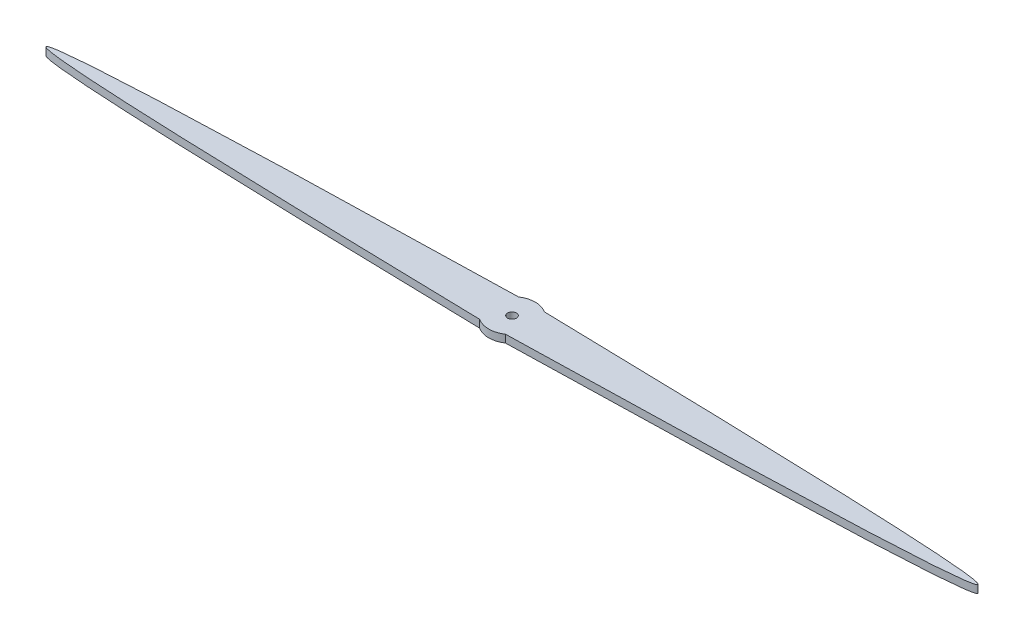
ISO-10303-21;
HEADER;
FILE_DESCRIPTION(('STEP AP214'),'2;1');
FILE_NAME('part.step','',(''),(''),'','','');
FILE_SCHEMA(('AUTOMOTIVE_DESIGN { 1 0 10303 214 1 1 1 1 }'));
ENDSEC;
DATA;
#1=APPLICATION_CONTEXT('core data for automotive mechanical design processes');
#2=APPLICATION_PROTOCOL_DEFINITION('international standard','automotive_design',2000,#1);
#3=PRODUCT_CONTEXT('',#1,'mechanical');
#4=PRODUCT('Part','Part','',(#3));
#5=PRODUCT_RELATED_PRODUCT_CATEGORY('part','',(#4));
#6=PRODUCT_DEFINITION_FORMATION('','',#4);
#7=PRODUCT_DEFINITION_CONTEXT('part definition',#1,'design');
#8=PRODUCT_DEFINITION('design','',#6,#7);
#9=PRODUCT_DEFINITION_SHAPE('','',#8);
#10=(LENGTH_UNIT() NAMED_UNIT(*) SI_UNIT(.MILLI.,.METRE.));
#11=(NAMED_UNIT(*) PLANE_ANGLE_UNIT() SI_UNIT($,.RADIAN.));
#12=(NAMED_UNIT(*) SI_UNIT($,.STERADIAN.) SOLID_ANGLE_UNIT());
#13=UNCERTAINTY_MEASURE_WITH_UNIT(LENGTH_MEASURE(1.E-05),#10,'distance_accuracy_value','');
#14=(GEOMETRIC_REPRESENTATION_CONTEXT(3) GLOBAL_UNCERTAINTY_ASSIGNED_CONTEXT((#13)) GLOBAL_UNIT_ASSIGNED_CONTEXT((#10,
#11,#12)) REPRESENTATION_CONTEXT('',''));
#15=CARTESIAN_POINT('',(0.,0.,0.));
#16=DIRECTION('',(0.,0.,1.));
#17=DIRECTION('',(1.,0.,0.));
#18=AXIS2_PLACEMENT_3D('',#15,#16,#17);
#19=CARTESIAN_POINT('',(152.4,2.5146,0.));
#20=DIRECTION('',(0.,1.,0.));
#21=DIRECTION('',(0.,0.,1.));
#22=AXIS2_PLACEMENT_3D('',#19,#20,#21);
#23=PLANE('',#22);
#24=CARTESIAN_POINT('',(4.21211348375136,2.5146,6.35));
#25=CARTESIAN_POINT('',(300.587886516249,2.5146,0.));
#26=CARTESIAN_POINT('',(4.21211348375136,2.5146,-6.35));
#27=B_SPLINE_CURVE_WITH_KNOTS('',2,(#24,#25,#26),.UNSPECIFIED.,.F.,.F.,(3,3),(0.,1.),.UNSPECIFIED.);
#28=CARTESIAN_POINT('',(4.21211348375136,2.5146,6.35));
#29=VERTEX_POINT('',#28);
#30=CARTESIAN_POINT('',(4.21211348375136,2.5146,-6.35));
#31=VERTEX_POINT('',#30);
#32=EDGE_CURVE('E98',#29,#31,#27,.T.);
#33=ORIENTED_EDGE('',*,*,#32,.T.);
#34=CARTESIAN_POINT('',(0.,2.5146,0.));
#35=DIRECTION('',(0.,1.,0.));
#36=DIRECTION('',(0.,0.,1.));
#37=AXIS2_PLACEMENT_3D('',#34,#35,#36);
#38=CIRCLE('',#37,7.62);
#39=CARTESIAN_POINT('',(-4.21211348375135,2.5146,-6.35));
#40=VERTEX_POINT('',#39);
#41=EDGE_CURVE('E85',#31,#40,#38,.T.);
#42=ORIENTED_EDGE('',*,*,#41,.T.);
#43=CARTESIAN_POINT('',(-4.21211348375136,2.5146,-6.35));
#44=CARTESIAN_POINT('',(-300.587886516249,2.5146,0.));
#45=CARTESIAN_POINT('',(-4.21211348375136,2.5146,6.35));
#46=B_SPLINE_CURVE_WITH_KNOTS('',2,(#43,#44,#45),.UNSPECIFIED.,.F.,.F.,(3,3),(0.,1.),.UNSPECIFIED.);
#47=CARTESIAN_POINT('',(-4.21211348375136,2.5146,6.35));
#48=VERTEX_POINT('',#47);
#49=EDGE_CURVE('E92',#40,#48,#46,.T.);
#50=ORIENTED_EDGE('',*,*,#49,.T.);
#51=CARTESIAN_POINT('',(0.,2.5146,0.));
#52=DIRECTION('',(0.,1.,0.));
#53=DIRECTION('',(0.,0.,1.));
#54=AXIS2_PLACEMENT_3D('',#51,#52,#53);
#55=CIRCLE('',#54,7.62);
#56=EDGE_CURVE('E95',#48,#29,#55,.T.);
#57=ORIENTED_EDGE('',*,*,#56,.T.);
#58=EDGE_LOOP('',(#33,#42,#50,#57));
#59=FACE_BOUND('',#58,.T.);
#60=CARTESIAN_POINT('',(0.,2.5146,0.));
#61=DIRECTION('',(0.,1.,0.));
#62=DIRECTION('',(0.,0.,1.));
#63=AXIS2_PLACEMENT_3D('',#60,#61,#62);
#64=CIRCLE('',#63,1.46304);
#65=CARTESIAN_POINT('',(0.,2.5146,1.46304));
#66=VERTEX_POINT('',#65);
#67=EDGE_CURVE('E139',#66,#66,#64,.T.);
#68=ORIENTED_EDGE('',*,*,#67,.F.);
#69=EDGE_LOOP('',(#68));
#70=FACE_BOUND('',#69,.T.);
#71=ADVANCED_FACE('F39',(#59,#70),#23,.T.);
#72=CARTESIAN_POINT('',(152.4,0.,0.));
#73=DIRECTION('',(0.,1.,0.));
#74=DIRECTION('',(0.,0.,1.));
#75=AXIS2_PLACEMENT_3D('',#72,#73,#74);
#76=PLANE('',#75);
#77=CARTESIAN_POINT('',(4.21211348375136,0.,6.35));
#78=CARTESIAN_POINT('',(300.587886516249,0.,0.));
#79=CARTESIAN_POINT('',(4.21211348375136,0.,-6.35));
#80=B_SPLINE_CURVE_WITH_KNOTS('',2,(#77,#78,#79),.UNSPECIFIED.,.F.,.F.,(3,3),(0.,1.),.UNSPECIFIED.);
#81=CARTESIAN_POINT('',(4.21211348375136,0.,6.35));
#82=VERTEX_POINT('',#81);
#83=CARTESIAN_POINT('',(4.21211348375136,0.,-6.35));
#84=VERTEX_POINT('',#83);
#85=EDGE_CURVE('E144',#82,#84,#80,.T.);
#86=ORIENTED_EDGE('',*,*,#85,.F.);
#87=CARTESIAN_POINT('',(0.,0.,0.));
#88=DIRECTION('',(0.,1.,0.));
#89=DIRECTION('',(0.,0.,1.));
#90=AXIS2_PLACEMENT_3D('',#87,#88,#89);
#91=CIRCLE('',#90,7.62);
#92=CARTESIAN_POINT('',(-4.21211348375136,0.,6.35));
#93=VERTEX_POINT('',#92);
#94=EDGE_CURVE('E100',#93,#82,#91,.T.);
#95=ORIENTED_EDGE('',*,*,#94,.F.);
#96=CARTESIAN_POINT('',(-4.21211348375136,0.,-6.35));
#97=CARTESIAN_POINT('',(-300.587886516249,0.,0.));
#98=CARTESIAN_POINT('',(-4.21211348375136,0.,6.35));
#99=B_SPLINE_CURVE_WITH_KNOTS('',2,(#96,#97,#98),.UNSPECIFIED.,.F.,.F.,(3,3),(0.,1.),.UNSPECIFIED.);
#100=CARTESIAN_POINT('',(-4.21211348375135,0.,-6.35));
#101=VERTEX_POINT('',#100);
#102=EDGE_CURVE('E147',#101,#93,#99,.T.);
#103=ORIENTED_EDGE('',*,*,#102,.F.);
#104=CARTESIAN_POINT('',(0.,0.,0.));
#105=DIRECTION('',(0.,1.,0.));
#106=DIRECTION('',(0.,0.,1.));
#107=AXIS2_PLACEMENT_3D('',#104,#105,#106);
#108=CIRCLE('',#107,7.62);
#109=EDGE_CURVE('E88',#84,#101,#108,.T.);
#110=ORIENTED_EDGE('',*,*,#109,.F.);
#111=EDGE_LOOP('',(#86,#95,#103,#110));
#112=FACE_BOUND('',#111,.T.);
#113=CARTESIAN_POINT('',(0.,0.,0.));
#114=DIRECTION('',(0.,1.,0.));
#115=DIRECTION('',(0.,0.,1.));
#116=AXIS2_PLACEMENT_3D('',#113,#114,#115);
#117=CIRCLE('',#116,1.46304);
#118=CARTESIAN_POINT('',(0.,0.,1.46304));
#119=VERTEX_POINT('',#118);
#120=EDGE_CURVE('E142',#119,#119,#117,.T.);
#121=ORIENTED_EDGE('',*,*,#120,.T.);
#122=EDGE_LOOP('',(#121));
#123=FACE_BOUND('',#122,.T.);
#124=ADVANCED_FACE('F122',(#112,#123),#76,.F.);
#125=DIRECTION('',(0.,-1.,0.));
#126=VECTOR('',#125,1.);
#127=SURFACE_OF_LINEAR_EXTRUSION('',#27,#126);
#128=ORIENTED_EDGE('',*,*,#85,.T.);
#129=DIRECTION('',(0.,-1.,0.));
#130=VECTOR('',#129,1.);
#131=CARTESIAN_POINT('',(4.21211348375136,2.5146,-6.35));
#132=LINE('',#131,#130);
#133=EDGE_CURVE('E11',#31,#84,#132,.T.);
#134=ORIENTED_EDGE('',*,*,#133,.F.);
#135=ORIENTED_EDGE('',*,*,#32,.F.);
#136=DIRECTION('',(0.,-1.,0.));
#137=VECTOR('',#136,1.);
#138=CARTESIAN_POINT('',(4.21211348375136,2.5146,6.35));
#139=LINE('',#138,#137);
#140=EDGE_CURVE('E57',#29,#82,#139,.T.);
#141=ORIENTED_EDGE('',*,*,#140,.T.);
#142=EDGE_LOOP('',(#128,#134,#135,#141));
#143=FACE_BOUND('',#142,.T.);
#144=ADVANCED_FACE('F41',(#143),#127,.F.);
#145=CARTESIAN_POINT('',(0.,2.5146,0.));
#146=DIRECTION('',(0.,-1.,0.));
#147=DIRECTION('',(0.,0.,-1.));
#148=AXIS2_PLACEMENT_3D('',#145,#146,#147);
#149=CYLINDRICAL_SURFACE('',#148,7.62);
#150=ORIENTED_EDGE('',*,*,#109,.T.);
#151=DIRECTION('',(0.,-1.,0.));
#152=VECTOR('',#151,1.);
#153=CARTESIAN_POINT('',(-4.21211348375135,2.5146,-6.35));
#154=LINE('',#153,#152);
#155=EDGE_CURVE('E49',#40,#101,#154,.T.);
#156=ORIENTED_EDGE('',*,*,#155,.F.);
#157=ORIENTED_EDGE('',*,*,#41,.F.);
#158=ORIENTED_EDGE('',*,*,#133,.T.);
#159=EDGE_LOOP('',(#150,#156,#157,#158));
#160=FACE_BOUND('',#159,.T.);
#161=ADVANCED_FACE('F83',(#160),#149,.T.);
#162=DIRECTION('',(0.,-1.,0.));
#163=VECTOR('',#162,1.);
#164=SURFACE_OF_LINEAR_EXTRUSION('',#46,#163);
#165=ORIENTED_EDGE('',*,*,#102,.T.);
#166=DIRECTION('',(0.,-1.,0.));
#167=VECTOR('',#166,1.);
#168=CARTESIAN_POINT('',(-4.21211348375136,2.5146,6.35));
#169=LINE('',#168,#167);
#170=EDGE_CURVE('E70',#48,#93,#169,.T.);
#171=ORIENTED_EDGE('',*,*,#170,.F.);
#172=ORIENTED_EDGE('',*,*,#49,.F.);
#173=ORIENTED_EDGE('',*,*,#155,.T.);
#174=EDGE_LOOP('',(#165,#171,#172,#173));
#175=FACE_BOUND('',#174,.T.);
#176=ADVANCED_FACE('F93',(#175),#164,.F.);
#177=CARTESIAN_POINT('',(0.,2.5146,0.));
#178=DIRECTION('',(0.,-1.,0.));
#179=DIRECTION('',(0.,0.,-1.));
#180=AXIS2_PLACEMENT_3D('',#177,#178,#179);
#181=CYLINDRICAL_SURFACE('',#180,7.62);
#182=ORIENTED_EDGE('',*,*,#94,.T.);
#183=ORIENTED_EDGE('',*,*,#140,.F.);
#184=ORIENTED_EDGE('',*,*,#56,.F.);
#185=ORIENTED_EDGE('',*,*,#170,.T.);
#186=EDGE_LOOP('',(#182,#183,#184,#185));
#187=FACE_BOUND('',#186,.T.);
#188=ADVANCED_FACE('F116',(#187),#181,.T.);
#189=CARTESIAN_POINT('',(0.,2.5146,0.));
#190=DIRECTION('',(0.,-1.,0.));
#191=DIRECTION('',(0.,0.,-1.));
#192=AXIS2_PLACEMENT_3D('',#189,#190,#191);
#193=CYLINDRICAL_SURFACE('',#192,1.46304);
#194=ORIENTED_EDGE('',*,*,#67,.T.);
#195=EDGE_LOOP('',(#194));
#196=FACE_BOUND('',#195,.T.);
#197=ORIENTED_EDGE('',*,*,#120,.F.);
#198=EDGE_LOOP('',(#197));
#199=FACE_BOUND('',#198,.T.);
#200=ADVANCED_FACE('F130',(#196,#199),#193,.F.);
#201=CLOSED_SHELL('',(#71,#124,#144,#161,#176,#188,#200));
#202=MANIFOLD_SOLID_BREP('B2',#201);
#203=ADVANCED_BREP_SHAPE_REPRESENTATION('',(#18,#202),#14);
#204=SHAPE_DEFINITION_REPRESENTATION(#9,#203);
ENDSEC;
END-ISO-10303-21;
